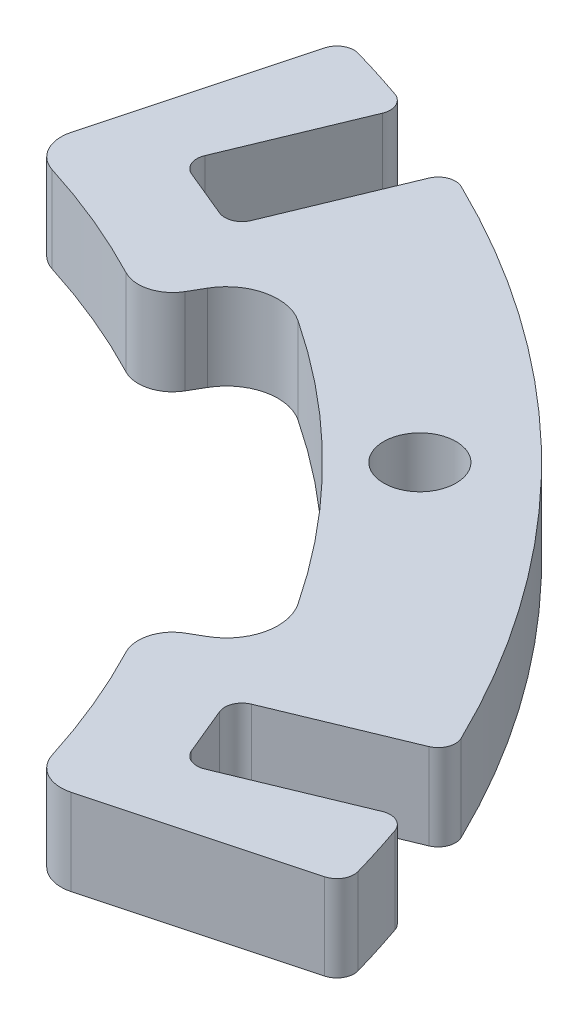
ISO-10303-21;
HEADER;
FILE_DESCRIPTION(('STEP AP214'),'2;1');
FILE_NAME('part.step','',(''),(''),'','','');
FILE_SCHEMA(('AUTOMOTIVE_DESIGN { 1 0 10303 214 1 1 1 1 }'));
ENDSEC;
DATA;
#1=APPLICATION_CONTEXT('core data for automotive mechanical design processes');
#2=APPLICATION_PROTOCOL_DEFINITION('international standard','automotive_design',2000,#1);
#3=PRODUCT_CONTEXT('',#1,'mechanical');
#4=PRODUCT('Part','Part','',(#3));
#5=PRODUCT_RELATED_PRODUCT_CATEGORY('part','',(#4));
#6=PRODUCT_DEFINITION_FORMATION('','',#4);
#7=PRODUCT_DEFINITION_CONTEXT('part definition',#1,'design');
#8=PRODUCT_DEFINITION('design','',#6,#7);
#9=PRODUCT_DEFINITION_SHAPE('','',#8);
#10=(LENGTH_UNIT() NAMED_UNIT(*) SI_UNIT(.MILLI.,.METRE.));
#11=(NAMED_UNIT(*) PLANE_ANGLE_UNIT() SI_UNIT($,.RADIAN.));
#12=(NAMED_UNIT(*) SI_UNIT($,.STERADIAN.) SOLID_ANGLE_UNIT());
#13=UNCERTAINTY_MEASURE_WITH_UNIT(LENGTH_MEASURE(1.E-05),#10,'distance_accuracy_value','');
#14=(GEOMETRIC_REPRESENTATION_CONTEXT(3) GLOBAL_UNCERTAINTY_ASSIGNED_CONTEXT((#13)) GLOBAL_UNIT_ASSIGNED_CONTEXT((#10,
#11,#12)) REPRESENTATION_CONTEXT('',''));
#15=CARTESIAN_POINT('',(0.,0.,0.));
#16=DIRECTION('',(0.,0.,1.));
#17=DIRECTION('',(1.,0.,0.));
#18=AXIS2_PLACEMENT_3D('',#15,#16,#17);
#19=CARTESIAN_POINT('',(0.,5.,0.));
#20=DIRECTION('',(0.,-1.,0.));
#21=DIRECTION('',(0.,0.,-1.));
#22=AXIS2_PLACEMENT_3D('',#19,#20,#21);
#23=CYLINDRICAL_SURFACE('',#22,60.);
#24=CARTESIAN_POINT('',(0.,0.,0.));
#25=DIRECTION('',(0.,1.,0.));
#26=DIRECTION('',(0.,0.,1.));
#27=AXIS2_PLACEMENT_3D('',#24,#25,#26);
#28=CIRCLE('',#27,60.);
#29=CARTESIAN_POINT('',(57.6840186161579,0.,-16.5092094386965));
#30=VERTEX_POINT('',#29);
#31=CARTESIAN_POINT('',(56.6972427250222,0.,-19.632184478043));
#32=VERTEX_POINT('',#31);
#33=EDGE_CURVE('E364',#30,#32,#28,.T.);
#34=ORIENTED_EDGE('',*,*,#33,.T.);
#35=DIRECTION('',(0.,-1.,0.));
#36=VECTOR('',#35,1.);
#37=CARTESIAN_POINT('',(56.6972427250222,5.,-19.632184478043));
#38=LINE('',#37,#36);
#39=CARTESIAN_POINT('',(56.6972427250222,5.,-19.632184478043));
#40=VERTEX_POINT('',#39);
#41=EDGE_CURVE('E425',#32,#40,#38,.F.);
#42=ORIENTED_EDGE('',*,*,#41,.T.);
#43=CARTESIAN_POINT('',(0.,5.,0.));
#44=DIRECTION('',(0.,1.,0.));
#45=DIRECTION('',(0.,0.,1.));
#46=AXIS2_PLACEMENT_3D('',#43,#44,#45);
#47=CIRCLE('',#46,60.);
#48=CARTESIAN_POINT('',(57.6840186161579,5.,-16.5092094386965));
#49=VERTEX_POINT('',#48);
#50=EDGE_CURVE('E358',#49,#40,#47,.T.);
#51=ORIENTED_EDGE('',*,*,#50,.F.);
#52=DIRECTION('',(0.,-1.,0.));
#53=VECTOR('',#52,1.);
#54=CARTESIAN_POINT('',(57.6840186161579,5.,-16.5092094386965));
#55=LINE('',#54,#53);
#56=EDGE_CURVE('E375',#49,#30,#55,.T.);
#57=ORIENTED_EDGE('',*,*,#56,.T.);
#58=EDGE_LOOP('',(#34,#42,#51,#57));
#59=FACE_BOUND('',#58,.T.);
#60=ADVANCED_FACE('F35',(#59),#23,.T.);
#61=CARTESIAN_POINT('',(53.9730555793724,5.,-26.2089540315132));
#62=VERTEX_POINT('',#61);
#63=CARTESIAN_POINT('',(26.2089540315133,5.,-53.9730555793724));
#64=VERTEX_POINT('',#63);
#65=EDGE_CURVE('E362',#62,#64,#47,.T.);
#66=ORIENTED_EDGE('',*,*,#65,.F.);
#67=DIRECTION('',(0.,-1.,0.));
#68=VECTOR('',#67,1.);
#69=CARTESIAN_POINT('',(53.9730555793724,5.,-26.2089540315132));
#70=LINE('',#69,#68);
#71=CARTESIAN_POINT('',(53.9730555793724,0.,-26.2089540315132));
#72=VERTEX_POINT('',#71);
#73=EDGE_CURVE('E448',#62,#72,#70,.T.);
#74=ORIENTED_EDGE('',*,*,#73,.T.);
#75=CARTESIAN_POINT('',(26.2089540315133,0.,-53.9730555793724));
#76=VERTEX_POINT('',#75);
#77=EDGE_CURVE('E367',#72,#76,#28,.T.);
#78=ORIENTED_EDGE('',*,*,#77,.T.);
#79=DIRECTION('',(0.,-1.,0.));
#80=VECTOR('',#79,1.);
#81=CARTESIAN_POINT('',(26.2089540315133,5.,-53.9730555793724));
#82=LINE('',#81,#80);
#83=EDGE_CURVE('E386',#76,#64,#82,.F.);
#84=ORIENTED_EDGE('',*,*,#83,.T.);
#85=EDGE_LOOP('',(#66,#74,#78,#84));
#86=FACE_BOUND('',#85,.T.);
#87=ADVANCED_FACE('F510',(#86),#23,.T.);
#88=CARTESIAN_POINT('',(0.,5.,0.));
#89=DIRECTION('',(0.,1.,0.));
#90=DIRECTION('',(0.,0.,1.));
#91=AXIS2_PLACEMENT_3D('',#88,#89,#90);
#92=PLANE('',#91);
#93=ORIENTED_EDGE('',*,*,#50,.T.);
#94=CARTESIAN_POINT('',(55.7522886796052,5.,-19.304981403409));
#95=DIRECTION('',(0.,1.,0.));
#96=DIRECTION('',(0.,0.,1.));
#97=AXIS2_PLACEMENT_3D('',#94,#95,#96);
#98=CIRCLE('',#97,1.);
#99=CARTESIAN_POINT('',(55.3696052472401,5.,-20.2288609359203));
#100=VERTEX_POINT('',#99);
#101=EDGE_CURVE('E430',#40,#100,#98,.T.);
#102=ORIENTED_EDGE('',*,*,#101,.T.);
#103=DIRECTION('',(0.923879532511285,0.,-0.382683432365095));
#104=VECTOR('',#103,1.);
#105=CARTESIAN_POINT('',(47.1506852064771,5.,-16.8244727869762));
#106=LINE('',#105,#104);
#107=CARTESIAN_POINT('',(48.0745647389884,5.,-17.2071562193413));
#108=VERTEX_POINT('',#107);
#109=EDGE_CURVE('E467',#108,#100,#106,.T.);
#110=ORIENTED_EDGE('',*,*,#109,.F.);
#111=CARTESIAN_POINT('',(47.6918813066233,5.,-18.1310357518526));
#112=DIRECTION('',(0.,1.,0.));
#113=DIRECTION('',(0.,0.,1.));
#114=AXIS2_PLACEMENT_3D('',#111,#112,#113);
#115=CIRCLE('',#114,1.);
#116=CARTESIAN_POINT('',(46.768001774112,5.,-17.7483523194875));
#117=VERTEX_POINT('',#116);
#118=EDGE_CURVE('E451',#108,#117,#115,.F.);
#119=ORIENTED_EDGE('',*,*,#118,.T.);
#120=DIRECTION('',(0.382683432365096,0.,0.923879532511284));
#121=VECTOR('',#120,1.);
#122=CARTESIAN_POINT('',(45.2372680446517,5.,-21.4438704495326));
#123=LINE('',#122,#121);
#124=CARTESIAN_POINT('',(45.6199514770167,5.,-20.5199909170213));
#125=VERTEX_POINT('',#124);
#126=EDGE_CURVE('E462',#125,#117,#123,.T.);
#127=ORIENTED_EDGE('',*,*,#126,.F.);
#128=CARTESIAN_POINT('',(46.543831009528,5.,-20.9026743493864));
#129=DIRECTION('',(0.,1.,0.));
#130=DIRECTION('',(0.,0.,1.));
#131=AXIS2_PLACEMENT_3D('',#128,#129,#130);
#132=CIRCLE('',#131,1.);
#133=CARTESIAN_POINT('',(46.1611475771629,5.,-21.8265538818977));
#134=VERTEX_POINT('',#133);
#135=EDGE_CURVE('E43',#125,#134,#132,.F.);
#136=ORIENTED_EDGE('',*,*,#135,.T.);
#137=DIRECTION('',(-0.923879532511285,0.,0.382683432365095));
#138=VECTOR('',#137,1.);
#139=CARTESIAN_POINT('',(45.2372680446517,5.,-21.4438704495326));
#140=LINE('',#139,#138);
#141=CARTESIAN_POINT('',(53.4561880854147,5.,-24.8482585984767));
#142=VERTEX_POINT('',#141);
#143=EDGE_CURVE('E459',#142,#134,#140,.T.);
#144=ORIENTED_EDGE('',*,*,#143,.F.);
#145=CARTESIAN_POINT('',(53.0735046530496,5.,-25.772138130988));
#146=DIRECTION('',(0.,1.,0.));
#147=DIRECTION('',(0.,0.,1.));
#148=AXIS2_PLACEMENT_3D('',#145,#146,#147);
#149=CIRCLE('',#148,1.);
#150=EDGE_CURVE('E428',#142,#62,#149,.T.);
#151=ORIENTED_EDGE('',*,*,#150,.T.);
#152=ORIENTED_EDGE('',*,*,#65,.T.);
#153=CARTESIAN_POINT('',(25.772138130988,5.,-53.0735046530496));
#154=DIRECTION('',(0.,1.,0.));
#155=DIRECTION('',(0.,0.,1.));
#156=AXIS2_PLACEMENT_3D('',#153,#154,#155);
#157=CIRCLE('',#156,1.);
#158=CARTESIAN_POINT('',(24.8482585984768,5.,-53.4561880854146));
#159=VERTEX_POINT('',#158);
#160=EDGE_CURVE('E391',#64,#159,#157,.T.);
#161=ORIENTED_EDGE('',*,*,#160,.T.);
#162=DIRECTION('',(0.382683432365083,0.,-0.92387953251129));
#163=VECTOR('',#162,1.);
#164=CARTESIAN_POINT('',(21.4438704495327,5.,-45.2372680446516));
#165=LINE('',#164,#163);
#166=CARTESIAN_POINT('',(21.8265538818978,5.,-46.1611475771629));
#167=VERTEX_POINT('',#166);
#168=EDGE_CURVE('E478',#167,#159,#165,.T.);
#169=ORIENTED_EDGE('',*,*,#168,.F.);
#170=CARTESIAN_POINT('',(20.9026743493865,5.,-46.543831009528));
#171=DIRECTION('',(0.,1.,0.));
#172=DIRECTION('',(0.,0.,1.));
#173=AXIS2_PLACEMENT_3D('',#170,#171,#172);
#174=CIRCLE('',#173,1.);
#175=CARTESIAN_POINT('',(20.5199909170215,5.,-45.6199514770167));
#176=VERTEX_POINT('',#175);
#177=EDGE_CURVE('E415',#167,#176,#174,.F.);
#178=ORIENTED_EDGE('',*,*,#177,.T.);
#179=DIRECTION('',(0.92387953251129,0.,0.382683432365082));
#180=VECTOR('',#179,1.);
#181=CARTESIAN_POINT('',(16.8244727869763,5.,-47.150685206477));
#182=LINE('',#181,#180);
#183=CARTESIAN_POINT('',(17.7483523194876,5.,-46.768001774112));
#184=VERTEX_POINT('',#183);
#185=EDGE_CURVE('E493',#184,#176,#182,.T.);
#186=ORIENTED_EDGE('',*,*,#185,.F.);
#187=CARTESIAN_POINT('',(18.1310357518527,5.,-47.6918813066232));
#188=DIRECTION('',(0.,1.,0.));
#189=DIRECTION('',(0.,0.,1.));
#190=AXIS2_PLACEMENT_3D('',#187,#188,#189);
#191=CIRCLE('',#190,1.);
#192=CARTESIAN_POINT('',(17.2071562193414,5.,-48.0745647389883));
#193=VERTEX_POINT('',#192);
#194=EDGE_CURVE('E419',#184,#193,#191,.F.);
#195=ORIENTED_EDGE('',*,*,#194,.T.);
#196=DIRECTION('',(-0.382683432365083,0.,0.92387953251129));
#197=VECTOR('',#196,1.);
#198=CARTESIAN_POINT('',(16.8244727869763,5.,-47.150685206477));
#199=LINE('',#198,#197);
#200=CARTESIAN_POINT('',(20.2288609359203,5.,-55.3696052472401));
#201=VERTEX_POINT('',#200);
#202=EDGE_CURVE('E482',#201,#193,#199,.T.);
#203=ORIENTED_EDGE('',*,*,#202,.F.);
#204=CARTESIAN_POINT('',(19.304981403409,5.,-55.7522886796052));
#205=DIRECTION('',(0.,1.,0.));
#206=DIRECTION('',(0.,0.,1.));
#207=AXIS2_PLACEMENT_3D('',#204,#205,#206);
#208=CIRCLE('',#207,1.);
#209=CARTESIAN_POINT('',(19.6321844780431,5.,-56.6972427250222));
#210=VERTEX_POINT('',#209);
#211=EDGE_CURVE('E389',#201,#210,#208,.T.);
#212=ORIENTED_EDGE('',*,*,#211,.T.);
#213=CARTESIAN_POINT('',(16.5092094386966,5.,-57.6840186161579));
#214=VERTEX_POINT('',#213);
#215=EDGE_CURVE('E363',#210,#214,#47,.T.);
#216=ORIENTED_EDGE('',*,*,#215,.T.);
#217=CARTESIAN_POINT('',(16.2340559480516,5.,-56.7226183058886));
#218=DIRECTION('',(0.,1.,0.));
#219=DIRECTION('',(0.,0.,1.));
#220=AXIS2_PLACEMENT_3D('',#217,#218,#219);
#221=CIRCLE('',#220,1.);
#222=CARTESIAN_POINT('',(15.2681301217625,5.,-56.9814373509911));
#223=VERTEX_POINT('',#222);
#224=EDGE_CURVE('E382',#214,#223,#221,.T.);
#225=ORIENTED_EDGE('',*,*,#224,.T.);
#226=DIRECTION('',(0.258819045102507,0.,-0.965925826289072));
#227=VECTOR('',#226,1.);
#228=CARTESIAN_POINT('',(12.3990261374576,5.,-46.2737955093662));
#229=LINE('',#228,#227);
#230=CARTESIAN_POINT('',(12.1534765531373,5.,-45.3573919849052));
#231=VERTEX_POINT('',#230);
#232=EDGE_CURVE('E340',#231,#223,#229,.T.);
#233=ORIENTED_EDGE('',*,*,#232,.F.);
#234=CARTESIAN_POINT('',(14.0853282057154,5.,-44.8397538947002));
#235=DIRECTION('',(0.,-1.,0.));
#236=DIRECTION('',(0.,0.,1.));
#237=AXIS2_PLACEMENT_3D('',#234,#235,#236);
#238=CIRCLE('',#237,2.00000000000001);
#239=CARTESIAN_POINT('',(13.4859525373871,5.,-42.9316792608831));
#240=VERTEX_POINT('',#239);
#241=EDGE_CURVE('E321',#240,#231,#238,.T.);
#242=ORIENTED_EDGE('',*,*,#241,.F.);
#243=CARTESIAN_POINT('',(0.,5.,0.));
#244=DIRECTION('',(0.,1.,0.));
#245=DIRECTION('',(0.,0.,1.));
#246=AXIS2_PLACEMENT_3D('',#243,#244,#245);
#247=CIRCLE('',#246,45.);
#248=CARTESIAN_POINT('',(20.8212730431501,5.,-39.8932900230426));
#249=VERTEX_POINT('',#248);
#250=EDGE_CURVE('E353',#249,#240,#247,.T.);
#251=ORIENTED_EDGE('',*,*,#250,.F.);
#252=CARTESIAN_POINT('',(21.746662956179,5.,-41.6663251351779));
#253=DIRECTION('',(0.,-1.,0.));
#254=DIRECTION('',(0.707106781186549,0.,-0.707106781186546));
#255=AXIS2_PLACEMENT_3D('',#252,#253,#254);
#256=CIRCLE('',#255,2.00000000000001);
#257=CARTESIAN_POINT('',(23.4787137637478,5.,-40.6663251351779));
#258=VERTEX_POINT('',#257);
#259=EDGE_CURVE('E282',#258,#249,#256,.T.);
#260=ORIENTED_EDGE('',*,*,#259,.F.);
#261=DIRECTION('',(-0.500000000000007,0.,0.866025403784435));
#262=VECTOR('',#261,1.);
#263=CARTESIAN_POINT('',(23.953079134007,5.,-41.487950057818));
#264=LINE('',#263,#262);
#265=CARTESIAN_POINT('',(23.953079134007,5.,-41.487950057818));
#266=VERTEX_POINT('',#265);
#267=EDGE_CURVE('E315',#266,#258,#264,.T.);
#268=ORIENTED_EDGE('',*,*,#267,.F.);
#269=CARTESIAN_POINT('',(26.5511553453603,5.,-39.987950057818));
#270=DIRECTION('',(0.,1.,0.));
#271=DIRECTION('',(-0.707106781186549,0.,0.707106781186546));
#272=AXIS2_PLACEMENT_3D('',#269,#270,#271);
#273=CIRCLE('',#272,3.);
#274=CARTESIAN_POINT('',(28.2106025544454,5.,-42.4871969364316));
#275=VERTEX_POINT('',#274);
#276=EDGE_CURVE('E312',#275,#266,#273,.T.);
#277=ORIENTED_EDGE('',*,*,#276,.F.);
#278=CARTESIAN_POINT('',(0.,5.,0.));
#279=DIRECTION('',(0.,1.,0.));
#280=DIRECTION('',(-0.707106781186549,0.,0.707106781186546));
#281=AXIS2_PLACEMENT_3D('',#278,#279,#280);
#282=CIRCLE('',#281,51.);
#283=CARTESIAN_POINT('',(42.4871969364317,5.,-28.2106025544452));
#284=VERTEX_POINT('',#283);
#285=EDGE_CURVE('E309',#284,#275,#282,.T.);
#286=ORIENTED_EDGE('',*,*,#285,.F.);
#287=CARTESIAN_POINT('',(39.9879500578181,5.,-26.5511553453602));
#288=DIRECTION('',(0.,1.,0.));
#289=DIRECTION('',(0.707106781186549,0.,-0.707106781186546));
#290=AXIS2_PLACEMENT_3D('',#287,#288,#289);
#291=CIRCLE('',#290,3.);
#292=CARTESIAN_POINT('',(41.4879500578181,5.,-23.9530791340069));
#293=VERTEX_POINT('',#292);
#294=EDGE_CURVE('E306',#293,#284,#291,.T.);
#295=ORIENTED_EDGE('',*,*,#294,.F.);
#296=DIRECTION('',(0.866025403784432,0.,-0.500000000000011));
#297=VECTOR('',#296,1.);
#298=CARTESIAN_POINT('',(41.4879500578181,5.,-23.9530791340069));
#299=LINE('',#298,#297);
#300=CARTESIAN_POINT('',(40.666325135178,5.,-23.4787137637477));
#301=VERTEX_POINT('',#300);
#302=EDGE_CURVE('E303',#301,#293,#299,.T.);
#303=ORIENTED_EDGE('',*,*,#302,.F.);
#304=CARTESIAN_POINT('',(41.666325135178,5.,-21.7466629561788));
#305=DIRECTION('',(0.,-1.,0.));
#306=DIRECTION('',(-0.707106781186549,0.,0.707106781186546));
#307=AXIS2_PLACEMENT_3D('',#304,#305,#306);
#308=CIRCLE('',#307,2.00000000000001);
#309=CARTESIAN_POINT('',(39.8932900230427,5.,-20.8212730431499));
#310=VERTEX_POINT('',#309);
#311=EDGE_CURVE('E276',#310,#301,#308,.T.);
#312=ORIENTED_EDGE('',*,*,#311,.F.);
#313=CARTESIAN_POINT('',(42.9316792608832,5.,-13.485952537387));
#314=VERTEX_POINT('',#313);
#315=EDGE_CURVE('E355',#314,#310,#247,.T.);
#316=ORIENTED_EDGE('',*,*,#315,.F.);
#317=CARTESIAN_POINT('',(44.8397538947002,5.,-14.0853282057153));
#318=DIRECTION('',(0.,-1.,0.));
#319=DIRECTION('',(1.,0.,0.));
#320=AXIS2_PLACEMENT_3D('',#317,#318,#319);
#321=CIRCLE('',#320,2.00000000000001);
#322=CARTESIAN_POINT('',(45.3573919849053,5.,-12.1534765531371));
#323=VERTEX_POINT('',#322);
#324=EDGE_CURVE('E257',#323,#314,#321,.T.);
#325=ORIENTED_EDGE('',*,*,#324,.F.);
#326=DIRECTION('',(-0.965925826289071,0.,0.258819045102512));
#327=VECTOR('',#326,1.);
#328=CARTESIAN_POINT('',(46.2737955093663,5.,-12.3990261374575));
#329=LINE('',#328,#327);
#330=CARTESIAN_POINT('',(56.9814373509912,5.,-15.2681301217625));
#331=VERTEX_POINT('',#330);
#332=EDGE_CURVE('E263',#331,#323,#329,.T.);
#333=ORIENTED_EDGE('',*,*,#332,.F.);
#334=CARTESIAN_POINT('',(56.7226183058886,5.,-16.2340559480515));
#335=DIRECTION('',(0.,1.,0.));
#336=DIRECTION('',(0.,0.,1.));
#337=AXIS2_PLACEMENT_3D('',#334,#335,#336);
#338=CIRCLE('',#337,1.);
#339=EDGE_CURVE('E380',#331,#49,#338,.T.);
#340=ORIENTED_EDGE('',*,*,#339,.T.);
#341=EDGE_LOOP('',(#93,#102,#110,#119,#127,#136,#144,#151,#152,#161,#169,#178,#186,#195,#203,
#212,#216,#225,#233,#242,#251,#260,#268,#277,#286,#295,#303,#312,#316,#325,#333,#340));
#342=FACE_BOUND('',#341,.T.);
#343=CARTESIAN_POINT('',(38.8908729652602,5.,-38.89087296526));
#344=DIRECTION('',(0.,1.,0.));
#345=DIRECTION('',(0.,0.,1.));
#346=AXIS2_PLACEMENT_3D('',#343,#344,#345);
#347=CIRCLE('',#346,2.1);
#348=CARTESIAN_POINT('',(38.8908729652602,5.,-36.79087296526));
#349=VERTEX_POINT('',#348);
#350=EDGE_CURVE('E498',#349,#349,#347,.T.);
#351=ORIENTED_EDGE('',*,*,#350,.F.);
#352=EDGE_LOOP('',(#351));
#353=FACE_BOUND('',#352,.T.);
#354=ADVANCED_FACE('F457',(#342,#353),#92,.T.);
#355=CARTESIAN_POINT('',(0.,0.,0.));
#356=DIRECTION('',(0.,1.,0.));
#357=DIRECTION('',(0.,0.,1.));
#358=AXIS2_PLACEMENT_3D('',#355,#356,#357);
#359=PLANE('',#358);
#360=CARTESIAN_POINT('',(38.8908729652602,0.,-38.89087296526));
#361=DIRECTION('',(0.,1.,0.));
#362=DIRECTION('',(0.,0.,1.));
#363=AXIS2_PLACEMENT_3D('',#360,#361,#362);
#364=CIRCLE('',#363,2.1);
#365=CARTESIAN_POINT('',(38.8908729652602,0.,-36.79087296526));
#366=VERTEX_POINT('',#365);
#367=EDGE_CURVE('E274',#366,#366,#364,.T.);
#368=ORIENTED_EDGE('',*,*,#367,.T.);
#369=EDGE_LOOP('',(#368));
#370=FACE_BOUND('',#369,.T.);
#371=DIRECTION('',(0.923879532511285,0.,-0.382683432365095));
#372=VECTOR('',#371,1.);
#373=CARTESIAN_POINT('',(47.1506852064771,0.,-16.8244727869762));
#374=LINE('',#373,#372);
#375=CARTESIAN_POINT('',(48.0745647389884,0.,-17.2071562193413));
#376=VERTEX_POINT('',#375);
#377=CARTESIAN_POINT('',(55.3696052472401,0.,-20.2288609359203));
#378=VERTEX_POINT('',#377);
#379=EDGE_CURVE('E479',#376,#378,#374,.T.);
#380=ORIENTED_EDGE('',*,*,#379,.T.);
#381=CARTESIAN_POINT('',(55.7522886796052,0.,-19.304981403409));
#382=DIRECTION('',(0.,1.,0.));
#383=DIRECTION('',(0.,0.,1.));
#384=AXIS2_PLACEMENT_3D('',#381,#382,#383);
#385=CIRCLE('',#384,1.);
#386=EDGE_CURVE('E438',#378,#32,#385,.F.);
#387=ORIENTED_EDGE('',*,*,#386,.T.);
#388=ORIENTED_EDGE('',*,*,#33,.F.);
#389=CARTESIAN_POINT('',(56.7226183058886,0.,-16.2340559480515));
#390=DIRECTION('',(0.,1.,0.));
#391=DIRECTION('',(0.,0.,1.));
#392=AXIS2_PLACEMENT_3D('',#389,#390,#391);
#393=CIRCLE('',#392,1.);
#394=CARTESIAN_POINT('',(56.9814373509912,0.,-15.2681301217625));
#395=VERTEX_POINT('',#394);
#396=EDGE_CURVE('E253',#30,#395,#393,.F.);
#397=ORIENTED_EDGE('',*,*,#396,.T.);
#398=DIRECTION('',(-0.965925826289071,0.,0.258819045102512));
#399=VECTOR('',#398,1.);
#400=CARTESIAN_POINT('',(46.2737955093663,0.,-12.3990261374575));
#401=LINE('',#400,#399);
#402=CARTESIAN_POINT('',(45.3573919849053,0.,-12.1534765531371));
#403=VERTEX_POINT('',#402);
#404=EDGE_CURVE('E243',#395,#403,#401,.T.);
#405=ORIENTED_EDGE('',*,*,#404,.T.);
#406=CARTESIAN_POINT('',(44.8397538947002,0.,-14.0853282057153));
#407=DIRECTION('',(0.,-1.,0.));
#408=DIRECTION('',(1.,0.,0.));
#409=AXIS2_PLACEMENT_3D('',#406,#407,#408);
#410=CIRCLE('',#409,2.00000000000001);
#411=CARTESIAN_POINT('',(42.9316792608832,0.,-13.4859525373869));
#412=VERTEX_POINT('',#411);
#413=EDGE_CURVE('E249',#403,#412,#410,.T.);
#414=ORIENTED_EDGE('',*,*,#413,.T.);
#415=CARTESIAN_POINT('',(0.,0.,0.));
#416=DIRECTION('',(0.,1.,0.));
#417=DIRECTION('',(0.,0.,1.));
#418=AXIS2_PLACEMENT_3D('',#415,#416,#417);
#419=CIRCLE('',#418,45.);
#420=CARTESIAN_POINT('',(39.8932900230427,0.,-20.8212730431499));
#421=VERTEX_POINT('',#420);
#422=EDGE_CURVE('E356',#412,#421,#419,.T.);
#423=ORIENTED_EDGE('',*,*,#422,.T.);
#424=CARTESIAN_POINT('',(41.666325135178,0.,-21.7466629561788));
#425=DIRECTION('',(0.,-1.,0.));
#426=DIRECTION('',(-0.707106781186549,0.,0.707106781186546));
#427=AXIS2_PLACEMENT_3D('',#424,#425,#426);
#428=CIRCLE('',#427,2.00000000000001);
#429=CARTESIAN_POINT('',(40.666325135178,0.,-23.4787137637477));
#430=VERTEX_POINT('',#429);
#431=EDGE_CURVE('E278',#421,#430,#428,.T.);
#432=ORIENTED_EDGE('',*,*,#431,.T.);
#433=DIRECTION('',(0.866025403784432,0.,-0.500000000000011));
#434=VECTOR('',#433,1.);
#435=CARTESIAN_POINT('',(41.4879500578181,0.,-23.9530791340069));
#436=LINE('',#435,#434);
#437=CARTESIAN_POINT('',(41.4879500578181,0.,-23.9530791340069));
#438=VERTEX_POINT('',#437);
#439=EDGE_CURVE('E281',#430,#438,#436,.T.);
#440=ORIENTED_EDGE('',*,*,#439,.T.);
#441=CARTESIAN_POINT('',(39.9879500578181,0.,-26.5511553453602));
#442=DIRECTION('',(0.,1.,0.));
#443=DIRECTION('',(0.707106781186549,0.,-0.707106781186546));
#444=AXIS2_PLACEMENT_3D('',#441,#442,#443);
#445=CIRCLE('',#444,3.);
#446=CARTESIAN_POINT('',(42.4871969364317,0.,-28.2106025544452));
#447=VERTEX_POINT('',#446);
#448=EDGE_CURVE('E285',#438,#447,#445,.T.);
#449=ORIENTED_EDGE('',*,*,#448,.T.);
#450=CARTESIAN_POINT('',(0.,0.,0.));
#451=DIRECTION('',(0.,1.,0.));
#452=DIRECTION('',(-0.707106781186549,0.,0.707106781186546));
#453=AXIS2_PLACEMENT_3D('',#450,#451,#452);
#454=CIRCLE('',#453,51.);
#455=CARTESIAN_POINT('',(28.2106025544454,0.,-42.4871969364316));
#456=VERTEX_POINT('',#455);
#457=EDGE_CURVE('E288',#447,#456,#454,.T.);
#458=ORIENTED_EDGE('',*,*,#457,.T.);
#459=CARTESIAN_POINT('',(26.5511553453603,0.,-39.987950057818));
#460=DIRECTION('',(0.,1.,0.));
#461=DIRECTION('',(-0.707106781186549,0.,0.707106781186546));
#462=AXIS2_PLACEMENT_3D('',#459,#460,#461);
#463=CIRCLE('',#462,3.);
#464=CARTESIAN_POINT('',(23.953079134007,0.,-41.487950057818));
#465=VERTEX_POINT('',#464);
#466=EDGE_CURVE('E291',#456,#465,#463,.T.);
#467=ORIENTED_EDGE('',*,*,#466,.T.);
#468=DIRECTION('',(-0.500000000000007,0.,0.866025403784435));
#469=VECTOR('',#468,1.);
#470=CARTESIAN_POINT('',(23.953079134007,0.,-41.487950057818));
#471=LINE('',#470,#469);
#472=CARTESIAN_POINT('',(23.4787137637478,0.,-40.6663251351779));
#473=VERTEX_POINT('',#472);
#474=EDGE_CURVE('E294',#465,#473,#471,.T.);
#475=ORIENTED_EDGE('',*,*,#474,.T.);
#476=CARTESIAN_POINT('',(21.746662956179,0.,-41.6663251351779));
#477=DIRECTION('',(0.,-1.,0.));
#478=DIRECTION('',(0.707106781186549,0.,-0.707106781186546));
#479=AXIS2_PLACEMENT_3D('',#476,#477,#478);
#480=CIRCLE('',#479,2.00000000000001);
#481=CARTESIAN_POINT('',(20.8212730431501,0.,-39.8932900230426));
#482=VERTEX_POINT('',#481);
#483=EDGE_CURVE('E297',#473,#482,#480,.T.);
#484=ORIENTED_EDGE('',*,*,#483,.T.);
#485=CARTESIAN_POINT('',(13.4859525373871,0.,-42.9316792608831));
#486=VERTEX_POINT('',#485);
#487=EDGE_CURVE('E351',#482,#486,#419,.T.);
#488=ORIENTED_EDGE('',*,*,#487,.T.);
#489=CARTESIAN_POINT('',(14.0853282057154,0.,-44.8397538947002));
#490=DIRECTION('',(0.,-1.,0.));
#491=DIRECTION('',(0.,0.,1.));
#492=AXIS2_PLACEMENT_3D('',#489,#490,#491);
#493=CIRCLE('',#492,2.00000000000001);
#494=CARTESIAN_POINT('',(12.1534765531373,0.,-45.3573919849052));
#495=VERTEX_POINT('',#494);
#496=EDGE_CURVE('E336',#486,#495,#493,.T.);
#497=ORIENTED_EDGE('',*,*,#496,.T.);
#498=DIRECTION('',(0.258819045102507,0.,-0.965925826289072));
#499=VECTOR('',#498,1.);
#500=CARTESIAN_POINT('',(12.3990261374576,0.,-46.2737955093662));
#501=LINE('',#500,#499);
#502=CARTESIAN_POINT('',(15.2681301217625,0.,-56.9814373509911));
#503=VERTEX_POINT('',#502);
#504=EDGE_CURVE('E339',#495,#503,#501,.T.);
#505=ORIENTED_EDGE('',*,*,#504,.T.);
#506=CARTESIAN_POINT('',(16.2340559480516,0.,-56.7226183058886));
#507=DIRECTION('',(0.,1.,0.));
#508=DIRECTION('',(0.,0.,1.));
#509=AXIS2_PLACEMENT_3D('',#506,#507,#508);
#510=CIRCLE('',#509,1.);
#511=CARTESIAN_POINT('',(16.5092094386966,0.,-57.6840186161579));
#512=VERTEX_POINT('',#511);
#513=EDGE_CURVE('E372',#503,#512,#510,.F.);
#514=ORIENTED_EDGE('',*,*,#513,.T.);
#515=CARTESIAN_POINT('',(19.6321844780431,0.,-56.6972427250222));
#516=VERTEX_POINT('',#515);
#517=EDGE_CURVE('E368',#516,#512,#28,.T.);
#518=ORIENTED_EDGE('',*,*,#517,.F.);
#519=CARTESIAN_POINT('',(19.304981403409,0.,-55.7522886796052));
#520=DIRECTION('',(0.,1.,0.));
#521=DIRECTION('',(0.,0.,1.));
#522=AXIS2_PLACEMENT_3D('',#519,#520,#521);
#523=CIRCLE('',#522,1.);
#524=CARTESIAN_POINT('',(20.2288609359203,0.,-55.3696052472401));
#525=VERTEX_POINT('',#524);
#526=EDGE_CURVE('E398',#516,#525,#523,.F.);
#527=ORIENTED_EDGE('',*,*,#526,.T.);
#528=DIRECTION('',(-0.382683432365083,0.,0.92387953251129));
#529=VECTOR('',#528,1.);
#530=CARTESIAN_POINT('',(16.8244727869763,0.,-47.150685206477));
#531=LINE('',#530,#529);
#532=CARTESIAN_POINT('',(17.2071562193414,0.,-48.0745647389883));
#533=VERTEX_POINT('',#532);
#534=EDGE_CURVE('E492',#525,#533,#531,.T.);
#535=ORIENTED_EDGE('',*,*,#534,.T.);
#536=CARTESIAN_POINT('',(18.1310357518527,0.,-47.6918813066232));
#537=DIRECTION('',(0.,1.,0.));
#538=DIRECTION('',(0.,0.,1.));
#539=AXIS2_PLACEMENT_3D('',#536,#537,#538);
#540=CIRCLE('',#539,1.);
#541=CARTESIAN_POINT('',(17.7483523194876,0.,-46.768001774112));
#542=VERTEX_POINT('',#541);
#543=EDGE_CURVE('E421',#533,#542,#540,.T.);
#544=ORIENTED_EDGE('',*,*,#543,.T.);
#545=DIRECTION('',(0.92387953251129,0.,0.382683432365082));
#546=VECTOR('',#545,1.);
#547=CARTESIAN_POINT('',(16.8244727869763,0.,-47.150685206477));
#548=LINE('',#547,#546);
#549=CARTESIAN_POINT('',(20.5199909170215,0.,-45.6199514770167));
#550=VERTEX_POINT('',#549);
#551=EDGE_CURVE('E496',#542,#550,#548,.T.);
#552=ORIENTED_EDGE('',*,*,#551,.T.);
#553=CARTESIAN_POINT('',(20.9026743493865,0.,-46.543831009528));
#554=DIRECTION('',(0.,1.,0.));
#555=DIRECTION('',(0.,0.,1.));
#556=AXIS2_PLACEMENT_3D('',#553,#554,#555);
#557=CIRCLE('',#556,1.);
#558=CARTESIAN_POINT('',(21.8265538818978,0.,-46.1611475771629));
#559=VERTEX_POINT('',#558);
#560=EDGE_CURVE('E417',#550,#559,#557,.T.);
#561=ORIENTED_EDGE('',*,*,#560,.T.);
#562=DIRECTION('',(0.382683432365083,0.,-0.92387953251129));
#563=VECTOR('',#562,1.);
#564=CARTESIAN_POINT('',(21.4438704495327,0.,-45.2372680446516));
#565=LINE('',#564,#563);
#566=CARTESIAN_POINT('',(24.8482585984768,0.,-53.4561880854146));
#567=VERTEX_POINT('',#566);
#568=EDGE_CURVE('E489',#559,#567,#565,.T.);
#569=ORIENTED_EDGE('',*,*,#568,.T.);
#570=CARTESIAN_POINT('',(25.772138130988,0.,-53.0735046530496));
#571=DIRECTION('',(0.,1.,0.));
#572=DIRECTION('',(0.,0.,1.));
#573=AXIS2_PLACEMENT_3D('',#570,#571,#572);
#574=CIRCLE('',#573,1.);
#575=EDGE_CURVE('E400',#567,#76,#574,.F.);
#576=ORIENTED_EDGE('',*,*,#575,.T.);
#577=ORIENTED_EDGE('',*,*,#77,.F.);
#578=CARTESIAN_POINT('',(53.0735046530496,0.,-25.772138130988));
#579=DIRECTION('',(0.,1.,0.));
#580=DIRECTION('',(0.,0.,1.));
#581=AXIS2_PLACEMENT_3D('',#578,#579,#580);
#582=CIRCLE('',#581,1.);
#583=CARTESIAN_POINT('',(53.4561880854147,0.,-24.8482585984767));
#584=VERTEX_POINT('',#583);
#585=EDGE_CURVE('E57',#72,#584,#582,.F.);
#586=ORIENTED_EDGE('',*,*,#585,.T.);
#587=DIRECTION('',(-0.923879532511285,0.,0.382683432365095));
#588=VECTOR('',#587,1.);
#589=CARTESIAN_POINT('',(-0.956708580912585,0.,-2.30969883127784));
#590=LINE('',#589,#588);
#591=CARTESIAN_POINT('',(46.161147577163,0.,-21.8265538818977));
#592=VERTEX_POINT('',#591);
#593=EDGE_CURVE('E423',#584,#592,#590,.T.);
#594=ORIENTED_EDGE('',*,*,#593,.T.);
#595=CARTESIAN_POINT('',(46.543831009528,0.,-20.9026743493864));
#596=DIRECTION('',(0.,1.,0.));
#597=DIRECTION('',(0.,0.,1.));
#598=AXIS2_PLACEMENT_3D('',#595,#596,#597);
#599=CIRCLE('',#598,1.);
#600=CARTESIAN_POINT('',(45.6199514770167,0.,-20.5199909170213));
#601=VERTEX_POINT('',#600);
#602=EDGE_CURVE('E12',#592,#601,#599,.T.);
#603=ORIENTED_EDGE('',*,*,#602,.T.);
#604=DIRECTION('',(0.382683432365096,0.,0.923879532511284));
#605=VECTOR('',#604,1.);
#606=CARTESIAN_POINT('',(45.2372680446517,0.,-21.4438704495326));
#607=LINE('',#606,#605);
#608=CARTESIAN_POINT('',(46.768001774112,0.,-17.7483523194875));
#609=VERTEX_POINT('',#608);
#610=EDGE_CURVE('E473',#601,#609,#607,.T.);
#611=ORIENTED_EDGE('',*,*,#610,.T.);
#612=CARTESIAN_POINT('',(47.6918813066233,0.,-18.1310357518526));
#613=DIRECTION('',(0.,1.,0.));
#614=DIRECTION('',(0.,0.,1.));
#615=AXIS2_PLACEMENT_3D('',#612,#613,#614);
#616=CIRCLE('',#615,1.);
#617=EDGE_CURVE('E453',#609,#376,#616,.T.);
#618=ORIENTED_EDGE('',*,*,#617,.T.);
#619=EDGE_LOOP('',(#380,#387,#388,#397,#405,#414,#423,#432,#440,#449,#458,#467,#475,#484,#488,
#497,#505,#514,#518,#527,#535,#544,#552,#561,#569,#576,#577,#586,#594,#603,#611,#618));
#620=FACE_BOUND('',#619,.T.);
#621=ADVANCED_FACE('F246',(#370,#620),#359,.F.);
#622=ORIENTED_EDGE('',*,*,#215,.F.);
#623=DIRECTION('',(0.,-1.,0.));
#624=VECTOR('',#623,1.);
#625=CARTESIAN_POINT('',(19.6321844780431,5.,-56.6972427250222));
#626=LINE('',#625,#624);
#627=EDGE_CURVE('E412',#210,#516,#626,.T.);
#628=ORIENTED_EDGE('',*,*,#627,.T.);
#629=ORIENTED_EDGE('',*,*,#517,.T.);
#630=DIRECTION('',(0.,-1.,0.));
#631=VECTOR('',#630,1.);
#632=CARTESIAN_POINT('',(16.5092094386966,5.,-57.6840186161579));
#633=LINE('',#632,#631);
#634=EDGE_CURVE('E377',#512,#214,#633,.F.);
#635=ORIENTED_EDGE('',*,*,#634,.T.);
#636=EDGE_LOOP('',(#622,#628,#629,#635));
#637=FACE_BOUND('',#636,.T.);
#638=ADVANCED_FACE('F516',(#637),#23,.T.);
#639=CARTESIAN_POINT('',(0.,5.,0.));
#640=DIRECTION('',(0.,-1.,0.));
#641=DIRECTION('',(0.,0.,-1.));
#642=AXIS2_PLACEMENT_3D('',#639,#640,#641);
#643=CYLINDRICAL_SURFACE('',#642,45.);
#644=ORIENTED_EDGE('',*,*,#422,.F.);
#645=DIRECTION('',(0.,1.,0.));
#646=VECTOR('',#645,1.);
#647=CARTESIAN_POINT('',(42.9316792608832,0.,-13.4859525373869));
#648=LINE('',#647,#646);
#649=EDGE_CURVE('E266',#412,#314,#648,.T.);
#650=ORIENTED_EDGE('',*,*,#649,.T.);
#651=ORIENTED_EDGE('',*,*,#315,.T.);
#652=DIRECTION('',(0.,1.,0.));
#653=VECTOR('',#652,1.);
#654=CARTESIAN_POINT('',(39.8932900230427,0.,-20.8212730431499));
#655=LINE('',#654,#653);
#656=EDGE_CURVE('E319',#421,#310,#655,.T.);
#657=ORIENTED_EDGE('',*,*,#656,.F.);
#658=EDGE_LOOP('',(#644,#650,#651,#657));
#659=FACE_BOUND('',#658,.T.);
#660=ADVANCED_FACE('F528',(#659),#643,.F.);
#661=ORIENTED_EDGE('',*,*,#487,.F.);
#662=DIRECTION('',(0.,1.,0.));
#663=VECTOR('',#662,1.);
#664=CARTESIAN_POINT('',(20.8212730431501,0.,-39.8932900230426));
#665=LINE('',#664,#663);
#666=EDGE_CURVE('E322',#482,#249,#665,.T.);
#667=ORIENTED_EDGE('',*,*,#666,.T.);
#668=ORIENTED_EDGE('',*,*,#250,.T.);
#669=DIRECTION('',(0.,1.,0.));
#670=VECTOR('',#669,1.);
#671=CARTESIAN_POINT('',(13.4859525373871,0.,-42.9316792608831));
#672=LINE('',#671,#670);
#673=EDGE_CURVE('E348',#486,#240,#672,.T.);
#674=ORIENTED_EDGE('',*,*,#673,.F.);
#675=EDGE_LOOP('',(#661,#667,#668,#674));
#676=FACE_BOUND('',#675,.T.);
#677=ADVANCED_FACE('F533',(#676),#643,.F.);
#678=CARTESIAN_POINT('',(14.0853282057154,0.,-44.8397538947002));
#679=DIRECTION('',(0.,1.,0.));
#680=DIRECTION('',(0.,0.,1.));
#681=AXIS2_PLACEMENT_3D('',#678,#679,#680);
#682=CYLINDRICAL_SURFACE('',#681,2.00000000000001);
#683=ORIENTED_EDGE('',*,*,#241,.T.);
#684=DIRECTION('',(0.,1.,0.));
#685=VECTOR('',#684,1.);
#686=CARTESIAN_POINT('',(12.1534765531373,0.,-45.3573919849052));
#687=LINE('',#686,#685);
#688=EDGE_CURVE('E343',#495,#231,#687,.T.);
#689=ORIENTED_EDGE('',*,*,#688,.F.);
#690=ORIENTED_EDGE('',*,*,#496,.F.);
#691=ORIENTED_EDGE('',*,*,#673,.T.);
#692=EDGE_LOOP('',(#683,#689,#690,#691));
#693=FACE_BOUND('',#692,.T.);
#694=ADVANCED_FACE('F609',(#693),#682,.T.);
#695=CARTESIAN_POINT('',(12.3990261374576,0.,-46.2737955093662));
#696=DIRECTION('',(0.965925826289072,0.,0.258819045102507));
#697=DIRECTION('',(0.258819045102507,0.,-0.965925826289072));
#698=AXIS2_PLACEMENT_3D('',#695,#696,#697);
#699=PLANE('',#698);
#700=ORIENTED_EDGE('',*,*,#232,.T.);
#701=DIRECTION('',(0.,-1.,0.));
#702=VECTOR('',#701,1.);
#703=CARTESIAN_POINT('',(15.2681301217625,0.,-56.9814373509911));
#704=LINE('',#703,#702);
#705=EDGE_CURVE('E361',#223,#503,#704,.T.);
#706=ORIENTED_EDGE('',*,*,#705,.T.);
#707=ORIENTED_EDGE('',*,*,#504,.F.);
#708=ORIENTED_EDGE('',*,*,#688,.T.);
#709=EDGE_LOOP('',(#700,#706,#707,#708));
#710=FACE_BOUND('',#709,.T.);
#711=ADVANCED_FACE('F613',(#710),#699,.F.);
#712=CARTESIAN_POINT('',(41.666325135178,0.,-21.7466629561788));
#713=DIRECTION('',(0.,1.,0.));
#714=DIRECTION('',(0.,0.,1.));
#715=AXIS2_PLACEMENT_3D('',#712,#713,#714);
#716=CYLINDRICAL_SURFACE('',#715,2.00000000000001);
#717=ORIENTED_EDGE('',*,*,#311,.T.);
#718=DIRECTION('',(0.,1.,0.));
#719=VECTOR('',#718,1.);
#720=CARTESIAN_POINT('',(40.666325135178,0.,-23.4787137637477));
#721=LINE('',#720,#719);
#722=EDGE_CURVE('E300',#430,#301,#721,.T.);
#723=ORIENTED_EDGE('',*,*,#722,.F.);
#724=ORIENTED_EDGE('',*,*,#431,.F.);
#725=ORIENTED_EDGE('',*,*,#656,.T.);
#726=EDGE_LOOP('',(#717,#723,#724,#725));
#727=FACE_BOUND('',#726,.T.);
#728=ADVANCED_FACE('F579',(#727),#716,.T.);
#729=CARTESIAN_POINT('',(21.746662956179,0.,-41.6663251351779));
#730=DIRECTION('',(0.,1.,0.));
#731=DIRECTION('',(0.,0.,1.));
#732=AXIS2_PLACEMENT_3D('',#729,#730,#731);
#733=CYLINDRICAL_SURFACE('',#732,2.00000000000001);
#734=ORIENTED_EDGE('',*,*,#259,.T.);
#735=ORIENTED_EDGE('',*,*,#666,.F.);
#736=ORIENTED_EDGE('',*,*,#483,.F.);
#737=DIRECTION('',(0.,1.,0.));
#738=VECTOR('',#737,1.);
#739=CARTESIAN_POINT('',(23.4787137637478,0.,-40.6663251351779));
#740=LINE('',#739,#738);
#741=EDGE_CURVE('E325',#473,#258,#740,.T.);
#742=ORIENTED_EDGE('',*,*,#741,.T.);
#743=EDGE_LOOP('',(#734,#735,#736,#742));
#744=FACE_BOUND('',#743,.T.);
#745=ADVANCED_FACE('F601',(#744),#733,.T.);
#746=CARTESIAN_POINT('',(23.953079134007,0.,-41.487950057818));
#747=DIRECTION('',(-0.866025403784435,0.,-0.500000000000007));
#748=DIRECTION('',(-0.500000000000007,0.,0.866025403784435));
#749=AXIS2_PLACEMENT_3D('',#746,#747,#748);
#750=PLANE('',#749);
#751=ORIENTED_EDGE('',*,*,#267,.T.);
#752=ORIENTED_EDGE('',*,*,#741,.F.);
#753=ORIENTED_EDGE('',*,*,#474,.F.);
#754=DIRECTION('',(0.,1.,0.));
#755=VECTOR('',#754,1.);
#756=CARTESIAN_POINT('',(23.953079134007,0.,-41.487950057818));
#757=LINE('',#756,#755);
#758=EDGE_CURVE('E327',#465,#266,#757,.T.);
#759=ORIENTED_EDGE('',*,*,#758,.T.);
#760=EDGE_LOOP('',(#751,#752,#753,#759));
#761=FACE_BOUND('',#760,.T.);
#762=ADVANCED_FACE('F597',(#761),#750,.F.);
#763=CARTESIAN_POINT('',(26.5511553453603,0.,-39.987950057818));
#764=DIRECTION('',(0.,1.,0.));
#765=DIRECTION('',(0.,0.,1.));
#766=AXIS2_PLACEMENT_3D('',#763,#764,#765);
#767=CYLINDRICAL_SURFACE('',#766,3.);
#768=ORIENTED_EDGE('',*,*,#276,.T.);
#769=ORIENTED_EDGE('',*,*,#758,.F.);
#770=ORIENTED_EDGE('',*,*,#466,.F.);
#771=DIRECTION('',(0.,1.,0.));
#772=VECTOR('',#771,1.);
#773=CARTESIAN_POINT('',(28.2106025544454,0.,-42.4871969364316));
#774=LINE('',#773,#772);
#775=EDGE_CURVE('E329',#456,#275,#774,.T.);
#776=ORIENTED_EDGE('',*,*,#775,.T.);
#777=EDGE_LOOP('',(#768,#769,#770,#776));
#778=FACE_BOUND('',#777,.T.);
#779=ADVANCED_FACE('F593',(#778),#767,.F.);
#780=CARTESIAN_POINT('',(0.,0.,0.));
#781=DIRECTION('',(0.,1.,0.));
#782=DIRECTION('',(0.,0.,1.));
#783=AXIS2_PLACEMENT_3D('',#780,#781,#782);
#784=CYLINDRICAL_SURFACE('',#783,51.);
#785=ORIENTED_EDGE('',*,*,#285,.T.);
#786=ORIENTED_EDGE('',*,*,#775,.F.);
#787=ORIENTED_EDGE('',*,*,#457,.F.);
#788=DIRECTION('',(0.,1.,0.));
#789=VECTOR('',#788,1.);
#790=CARTESIAN_POINT('',(42.4871969364317,0.,-28.2106025544452));
#791=LINE('',#790,#789);
#792=EDGE_CURVE('E331',#447,#284,#791,.T.);
#793=ORIENTED_EDGE('',*,*,#792,.T.);
#794=EDGE_LOOP('',(#785,#786,#787,#793));
#795=FACE_BOUND('',#794,.T.);
#796=ADVANCED_FACE('F589',(#795),#784,.F.);
#797=CARTESIAN_POINT('',(39.9879500578181,0.,-26.5511553453602));
#798=DIRECTION('',(0.,1.,0.));
#799=DIRECTION('',(0.,0.,1.));
#800=AXIS2_PLACEMENT_3D('',#797,#798,#799);
#801=CYLINDRICAL_SURFACE('',#800,3.);
#802=ORIENTED_EDGE('',*,*,#294,.T.);
#803=ORIENTED_EDGE('',*,*,#792,.F.);
#804=ORIENTED_EDGE('',*,*,#448,.F.);
#805=DIRECTION('',(0.,1.,0.));
#806=VECTOR('',#805,1.);
#807=CARTESIAN_POINT('',(41.4879500578181,0.,-23.9530791340069));
#808=LINE('',#807,#806);
#809=EDGE_CURVE('E333',#438,#293,#808,.T.);
#810=ORIENTED_EDGE('',*,*,#809,.T.);
#811=EDGE_LOOP('',(#802,#803,#804,#810));
#812=FACE_BOUND('',#811,.T.);
#813=ADVANCED_FACE('F585',(#812),#801,.F.);
#814=CARTESIAN_POINT('',(41.4879500578181,0.,-23.9530791340069));
#815=DIRECTION('',(0.500000000000011,0.,0.866025403784432));
#816=DIRECTION('',(0.866025403784432,0.,-0.500000000000011));
#817=AXIS2_PLACEMENT_3D('',#814,#815,#816);
#818=PLANE('',#817);
#819=ORIENTED_EDGE('',*,*,#302,.T.);
#820=ORIENTED_EDGE('',*,*,#809,.F.);
#821=ORIENTED_EDGE('',*,*,#439,.F.);
#822=ORIENTED_EDGE('',*,*,#722,.T.);
#823=EDGE_LOOP('',(#819,#820,#821,#822));
#824=FACE_BOUND('',#823,.T.);
#825=ADVANCED_FACE('F583',(#824),#818,.F.);
#826=CARTESIAN_POINT('',(44.8397538947002,0.,-14.0853282057153));
#827=DIRECTION('',(0.,1.,0.));
#828=DIRECTION('',(0.,0.,1.));
#829=AXIS2_PLACEMENT_3D('',#826,#827,#828);
#830=CYLINDRICAL_SURFACE('',#829,2.00000000000001);
#831=ORIENTED_EDGE('',*,*,#324,.T.);
#832=ORIENTED_EDGE('',*,*,#649,.F.);
#833=ORIENTED_EDGE('',*,*,#413,.F.);
#834=DIRECTION('',(0.,1.,0.));
#835=VECTOR('',#834,1.);
#836=CARTESIAN_POINT('',(45.3573919849053,0.,-12.1534765531371));
#837=LINE('',#836,#835);
#838=EDGE_CURVE('E260',#403,#323,#837,.T.);
#839=ORIENTED_EDGE('',*,*,#838,.T.);
#840=EDGE_LOOP('',(#831,#832,#833,#839));
#841=FACE_BOUND('',#840,.T.);
#842=ADVANCED_FACE('F268',(#841),#830,.T.);
#843=CARTESIAN_POINT('',(46.2737955093663,0.,-12.3990261374575));
#844=DIRECTION('',(-0.258819045102512,0.,-0.965925826289071));
#845=DIRECTION('',(-0.965925826289071,0.,0.258819045102512));
#846=AXIS2_PLACEMENT_3D('',#843,#844,#845);
#847=PLANE('',#846);
#848=ORIENTED_EDGE('',*,*,#404,.F.);
#849=DIRECTION('',(0.,-1.,0.));
#850=VECTOR('',#849,1.);
#851=CARTESIAN_POINT('',(56.9814373509912,0.,-15.2681301217625));
#852=LINE('',#851,#850);
#853=EDGE_CURVE('E384',#395,#331,#852,.F.);
#854=ORIENTED_EDGE('',*,*,#853,.T.);
#855=ORIENTED_EDGE('',*,*,#332,.T.);
#856=ORIENTED_EDGE('',*,*,#838,.F.);
#857=EDGE_LOOP('',(#848,#854,#855,#856));
#858=FACE_BOUND('',#857,.T.);
#859=ADVANCED_FACE('F261',(#858),#847,.F.);
#860=CARTESIAN_POINT('',(38.8908729652602,0.,-38.89087296526));
#861=DIRECTION('',(0.,1.,0.));
#862=DIRECTION('',(0.,0.,1.));
#863=AXIS2_PLACEMENT_3D('',#860,#861,#862);
#864=CYLINDRICAL_SURFACE('',#863,2.1);
#865=ORIENTED_EDGE('',*,*,#367,.F.);
#866=EDGE_LOOP('',(#865));
#867=FACE_BOUND('',#866,.T.);
#868=ORIENTED_EDGE('',*,*,#350,.T.);
#869=EDGE_LOOP('',(#868));
#870=FACE_BOUND('',#869,.T.);
#871=ADVANCED_FACE('F508',(#867,#870),#864,.F.);
#872=CARTESIAN_POINT('',(16.2340559480516,5.,-56.7226183058886));
#873=DIRECTION('',(0.,-1.,0.));
#874=DIRECTION('',(0.,0.,-1.));
#875=AXIS2_PLACEMENT_3D('',#872,#873,#874);
#876=CYLINDRICAL_SURFACE('',#875,1.);
#877=ORIENTED_EDGE('',*,*,#224,.F.);
#878=ORIENTED_EDGE('',*,*,#634,.F.);
#879=ORIENTED_EDGE('',*,*,#513,.F.);
#880=ORIENTED_EDGE('',*,*,#705,.F.);
#881=EDGE_LOOP('',(#877,#878,#879,#880));
#882=FACE_BOUND('',#881,.T.);
#883=ADVANCED_FACE('F616',(#882),#876,.T.);
#884=CARTESIAN_POINT('',(56.7226183058886,5.,-16.2340559480515));
#885=DIRECTION('',(0.,-1.,0.));
#886=DIRECTION('',(0.,0.,-1.));
#887=AXIS2_PLACEMENT_3D('',#884,#885,#886);
#888=CYLINDRICAL_SURFACE('',#887,1.);
#889=ORIENTED_EDGE('',*,*,#396,.F.);
#890=ORIENTED_EDGE('',*,*,#56,.F.);
#891=ORIENTED_EDGE('',*,*,#339,.F.);
#892=ORIENTED_EDGE('',*,*,#853,.F.);
#893=EDGE_LOOP('',(#889,#890,#891,#892));
#894=FACE_BOUND('',#893,.T.);
#895=ADVANCED_FACE('F618',(#894),#888,.T.);
#896=CARTESIAN_POINT('',(21.4438704495327,0.,-45.2372680446516));
#897=DIRECTION('',(0.92387953251129,0.,0.382683432365083));
#898=DIRECTION('',(0.382683432365083,0.,-0.92387953251129));
#899=AXIS2_PLACEMENT_3D('',#896,#897,#898);
#900=PLANE('',#899);
#901=ORIENTED_EDGE('',*,*,#168,.T.);
#902=DIRECTION('',(0.,-1.,0.));
#903=VECTOR('',#902,1.);
#904=CARTESIAN_POINT('',(24.8482585984768,0.,-53.4561880854146));
#905=LINE('',#904,#903);
#906=EDGE_CURVE('E396',#159,#567,#905,.T.);
#907=ORIENTED_EDGE('',*,*,#906,.T.);
#908=ORIENTED_EDGE('',*,*,#568,.F.);
#909=DIRECTION('',(0.,1.,0.));
#910=VECTOR('',#909,1.);
#911=CARTESIAN_POINT('',(21.8265538818978,5.,-46.1611475771629));
#912=LINE('',#911,#910);
#913=EDGE_CURVE('E393',#559,#167,#912,.T.);
#914=ORIENTED_EDGE('',*,*,#913,.T.);
#915=EDGE_LOOP('',(#901,#907,#908,#914));
#916=FACE_BOUND('',#915,.T.);
#917=ADVANCED_FACE('F565',(#916),#900,.F.);
#918=CARTESIAN_POINT('',(16.8244727869763,0.,-47.150685206477));
#919=DIRECTION('',(-0.92387953251129,0.,-0.382683432365083));
#920=DIRECTION('',(-0.382683432365083,0.,0.92387953251129));
#921=AXIS2_PLACEMENT_3D('',#918,#919,#920);
#922=PLANE('',#921);
#923=ORIENTED_EDGE('',*,*,#202,.T.);
#924=DIRECTION('',(0.,1.,0.));
#925=VECTOR('',#924,1.);
#926=CARTESIAN_POINT('',(17.2071562193414,0.,-48.0745647389883));
#927=LINE('',#926,#925);
#928=EDGE_CURVE('E410',#193,#533,#927,.F.);
#929=ORIENTED_EDGE('',*,*,#928,.T.);
#930=ORIENTED_EDGE('',*,*,#534,.F.);
#931=DIRECTION('',(0.,-1.,0.));
#932=VECTOR('',#931,1.);
#933=CARTESIAN_POINT('',(20.2288609359203,0.,-55.3696052472401));
#934=LINE('',#933,#932);
#935=EDGE_CURVE('E408',#525,#201,#934,.F.);
#936=ORIENTED_EDGE('',*,*,#935,.T.);
#937=EDGE_LOOP('',(#923,#929,#930,#936));
#938=FACE_BOUND('',#937,.T.);
#939=ADVANCED_FACE('F547',(#938),#922,.F.);
#940=CARTESIAN_POINT('',(16.8244727869763,0.,-47.150685206477));
#941=DIRECTION('',(-0.382683432365082,0.,0.92387953251129));
#942=DIRECTION('',(0.92387953251129,0.,0.382683432365082));
#943=AXIS2_PLACEMENT_3D('',#940,#941,#942);
#944=PLANE('',#943);
#945=ORIENTED_EDGE('',*,*,#185,.T.);
#946=DIRECTION('',(0.,1.,0.));
#947=VECTOR('',#946,1.);
#948=CARTESIAN_POINT('',(20.5199909170215,0.,-45.6199514770167));
#949=LINE('',#948,#947);
#950=EDGE_CURVE('E406',#176,#550,#949,.F.);
#951=ORIENTED_EDGE('',*,*,#950,.T.);
#952=ORIENTED_EDGE('',*,*,#551,.F.);
#953=DIRECTION('',(0.,1.,0.));
#954=VECTOR('',#953,1.);
#955=CARTESIAN_POINT('',(17.7483523194876,5.,-46.768001774112));
#956=LINE('',#955,#954);
#957=EDGE_CURVE('E403',#542,#184,#956,.T.);
#958=ORIENTED_EDGE('',*,*,#957,.T.);
#959=EDGE_LOOP('',(#945,#951,#952,#958));
#960=FACE_BOUND('',#959,.T.);
#961=ADVANCED_FACE('F556',(#960),#944,.F.);
#962=CARTESIAN_POINT('',(25.772138130988,5.,-53.0735046530496));
#963=DIRECTION('',(0.,-1.,0.));
#964=DIRECTION('',(0.,0.,-1.));
#965=AXIS2_PLACEMENT_3D('',#962,#963,#964);
#966=CYLINDRICAL_SURFACE('',#965,1.);
#967=ORIENTED_EDGE('',*,*,#575,.F.);
#968=ORIENTED_EDGE('',*,*,#906,.F.);
#969=ORIENTED_EDGE('',*,*,#160,.F.);
#970=ORIENTED_EDGE('',*,*,#83,.F.);
#971=EDGE_LOOP('',(#967,#968,#969,#970));
#972=FACE_BOUND('',#971,.T.);
#973=ADVANCED_FACE('F570',(#972),#966,.T.);
#974=CARTESIAN_POINT('',(20.9026743493865,0.,-46.543831009528));
#975=DIRECTION('',(0.,-1.,0.));
#976=DIRECTION('',(0.,0.,-1.));
#977=AXIS2_PLACEMENT_3D('',#974,#975,#976);
#978=CYLINDRICAL_SURFACE('',#977,1.);
#979=ORIENTED_EDGE('',*,*,#560,.F.);
#980=ORIENTED_EDGE('',*,*,#950,.F.);
#981=ORIENTED_EDGE('',*,*,#177,.F.);
#982=ORIENTED_EDGE('',*,*,#913,.F.);
#983=EDGE_LOOP('',(#979,#980,#981,#982));
#984=FACE_BOUND('',#983,.T.);
#985=ADVANCED_FACE('F560',(#984),#978,.F.);
#986=CARTESIAN_POINT('',(18.1310357518527,0.,-47.6918813066232));
#987=DIRECTION('',(0.,-1.,0.));
#988=DIRECTION('',(0.,0.,-1.));
#989=AXIS2_PLACEMENT_3D('',#986,#987,#988);
#990=CYLINDRICAL_SURFACE('',#989,1.);
#991=ORIENTED_EDGE('',*,*,#543,.F.);
#992=ORIENTED_EDGE('',*,*,#928,.F.);
#993=ORIENTED_EDGE('',*,*,#194,.F.);
#994=ORIENTED_EDGE('',*,*,#957,.F.);
#995=EDGE_LOOP('',(#991,#992,#993,#994));
#996=FACE_BOUND('',#995,.T.);
#997=ADVANCED_FACE('F551',(#996),#990,.F.);
#998=CARTESIAN_POINT('',(19.304981403409,5.,-55.7522886796052));
#999=DIRECTION('',(0.,-1.,0.));
#1000=DIRECTION('',(0.,0.,-1.));
#1001=AXIS2_PLACEMENT_3D('',#998,#999,#1000);
#1002=CYLINDRICAL_SURFACE('',#1001,1.);
#1003=ORIENTED_EDGE('',*,*,#211,.F.);
#1004=ORIENTED_EDGE('',*,*,#935,.F.);
#1005=ORIENTED_EDGE('',*,*,#526,.F.);
#1006=ORIENTED_EDGE('',*,*,#627,.F.);
#1007=EDGE_LOOP('',(#1003,#1004,#1005,#1006));
#1008=FACE_BOUND('',#1007,.T.);
#1009=ADVANCED_FACE('F542',(#1008),#1002,.T.);
#1010=CARTESIAN_POINT('',(47.1506852064771,0.,-16.8244727869762));
#1011=DIRECTION('',(0.382683432365095,0.,0.923879532511285));
#1012=DIRECTION('',(0.923879532511285,0.,-0.382683432365095));
#1013=AXIS2_PLACEMENT_3D('',#1010,#1011,#1012);
#1014=PLANE('',#1013);
#1015=ORIENTED_EDGE('',*,*,#109,.T.);
#1016=DIRECTION('',(0.,-1.,0.));
#1017=VECTOR('',#1016,1.);
#1018=CARTESIAN_POINT('',(55.3696052472401,0.,-20.2288609359203));
#1019=LINE('',#1018,#1017);
#1020=EDGE_CURVE('E435',#100,#378,#1019,.T.);
#1021=ORIENTED_EDGE('',*,*,#1020,.T.);
#1022=ORIENTED_EDGE('',*,*,#379,.F.);
#1023=DIRECTION('',(0.,1.,0.));
#1024=VECTOR('',#1023,1.);
#1025=CARTESIAN_POINT('',(48.0745647389884,5.,-17.2071562193413));
#1026=LINE('',#1025,#1024);
#1027=EDGE_CURVE('E432',#376,#108,#1026,.T.);
#1028=ORIENTED_EDGE('',*,*,#1027,.T.);
#1029=EDGE_LOOP('',(#1015,#1021,#1022,#1028));
#1030=FACE_BOUND('',#1029,.T.);
#1031=ADVANCED_FACE('F636',(#1030),#1014,.F.);
#1032=CARTESIAN_POINT('',(45.2372680446517,0.,-21.4438704495326));
#1033=DIRECTION('',(-0.382683432365095,0.,-0.923879532511285));
#1034=DIRECTION('',(-0.923879532511285,0.,0.382683432365095));
#1035=AXIS2_PLACEMENT_3D('',#1032,#1033,#1034);
#1036=PLANE('',#1035);
#1037=ORIENTED_EDGE('',*,*,#143,.T.);
#1038=DIRECTION('',(0.,1.,0.));
#1039=VECTOR('',#1038,1.);
#1040=CARTESIAN_POINT('',(46.1611475771629,0.,-21.8265538818977));
#1041=LINE('',#1040,#1039);
#1042=EDGE_CURVE('E50',#134,#592,#1041,.F.);
#1043=ORIENTED_EDGE('',*,*,#1042,.T.);
#1044=ORIENTED_EDGE('',*,*,#593,.F.);
#1045=DIRECTION('',(0.,-1.,0.));
#1046=VECTOR('',#1045,1.);
#1047=CARTESIAN_POINT('',(53.4561880854147,0.,-24.8482585984767));
#1048=LINE('',#1047,#1046);
#1049=EDGE_CURVE('E445',#584,#142,#1048,.F.);
#1050=ORIENTED_EDGE('',*,*,#1049,.T.);
#1051=EDGE_LOOP('',(#1037,#1043,#1044,#1050));
#1052=FACE_BOUND('',#1051,.T.);
#1053=ADVANCED_FACE('F465',(#1052),#1036,.F.);
#1054=CARTESIAN_POINT('',(45.2372680446517,0.,-21.4438704495326));
#1055=DIRECTION('',(-0.923879532511284,0.,0.382683432365096));
#1056=DIRECTION('',(0.382683432365096,0.,0.923879532511284));
#1057=AXIS2_PLACEMENT_3D('',#1054,#1055,#1056);
#1058=PLANE('',#1057);
#1059=ORIENTED_EDGE('',*,*,#126,.T.);
#1060=DIRECTION('',(0.,1.,0.));
#1061=VECTOR('',#1060,1.);
#1062=CARTESIAN_POINT('',(46.768001774112,0.,-17.7483523194875));
#1063=LINE('',#1062,#1061);
#1064=EDGE_CURVE('E443',#117,#609,#1063,.F.);
#1065=ORIENTED_EDGE('',*,*,#1064,.T.);
#1066=ORIENTED_EDGE('',*,*,#610,.F.);
#1067=DIRECTION('',(0.,1.,0.));
#1068=VECTOR('',#1067,1.);
#1069=CARTESIAN_POINT('',(45.6199514770167,5.,-20.5199909170213));
#1070=LINE('',#1069,#1068);
#1071=EDGE_CURVE('E440',#601,#125,#1070,.T.);
#1072=ORIENTED_EDGE('',*,*,#1071,.T.);
#1073=EDGE_LOOP('',(#1059,#1065,#1066,#1072));
#1074=FACE_BOUND('',#1073,.T.);
#1075=ADVANCED_FACE('F476',(#1074),#1058,.F.);
#1076=CARTESIAN_POINT('',(55.7522886796052,5.,-19.304981403409));
#1077=DIRECTION('',(0.,-1.,0.));
#1078=DIRECTION('',(0.,0.,-1.));
#1079=AXIS2_PLACEMENT_3D('',#1076,#1077,#1078);
#1080=CYLINDRICAL_SURFACE('',#1079,1.);
#1081=ORIENTED_EDGE('',*,*,#386,.F.);
#1082=ORIENTED_EDGE('',*,*,#1020,.F.);
#1083=ORIENTED_EDGE('',*,*,#101,.F.);
#1084=ORIENTED_EDGE('',*,*,#41,.F.);
#1085=EDGE_LOOP('',(#1081,#1082,#1083,#1084));
#1086=FACE_BOUND('',#1085,.T.);
#1087=ADVANCED_FACE('F637',(#1086),#1080,.T.);
#1088=CARTESIAN_POINT('',(47.6918813066233,0.,-18.1310357518526));
#1089=DIRECTION('',(0.,-1.,0.));
#1090=DIRECTION('',(0.,0.,-1.));
#1091=AXIS2_PLACEMENT_3D('',#1088,#1089,#1090);
#1092=CYLINDRICAL_SURFACE('',#1091,1.);
#1093=ORIENTED_EDGE('',*,*,#617,.F.);
#1094=ORIENTED_EDGE('',*,*,#1064,.F.);
#1095=ORIENTED_EDGE('',*,*,#118,.F.);
#1096=ORIENTED_EDGE('',*,*,#1027,.F.);
#1097=EDGE_LOOP('',(#1093,#1094,#1095,#1096));
#1098=FACE_BOUND('',#1097,.T.);
#1099=ADVANCED_FACE('F640',(#1098),#1092,.F.);
#1100=CARTESIAN_POINT('',(46.543831009528,0.,-20.9026743493864));
#1101=DIRECTION('',(0.,-1.,0.));
#1102=DIRECTION('',(0.,0.,-1.));
#1103=AXIS2_PLACEMENT_3D('',#1100,#1101,#1102);
#1104=CYLINDRICAL_SURFACE('',#1103,1.);
#1105=ORIENTED_EDGE('',*,*,#602,.F.);
#1106=ORIENTED_EDGE('',*,*,#1042,.F.);
#1107=ORIENTED_EDGE('',*,*,#135,.F.);
#1108=ORIENTED_EDGE('',*,*,#1071,.F.);
#1109=EDGE_LOOP('',(#1105,#1106,#1107,#1108));
#1110=FACE_BOUND('',#1109,.T.);
#1111=ADVANCED_FACE('F470',(#1110),#1104,.F.);
#1112=CARTESIAN_POINT('',(53.0735046530496,5.,-25.772138130988));
#1113=DIRECTION('',(0.,-1.,0.));
#1114=DIRECTION('',(0.,0.,-1.));
#1115=AXIS2_PLACEMENT_3D('',#1112,#1113,#1114);
#1116=CYLINDRICAL_SURFACE('',#1115,1.);
#1117=ORIENTED_EDGE('',*,*,#150,.F.);
#1118=ORIENTED_EDGE('',*,*,#1049,.F.);
#1119=ORIENTED_EDGE('',*,*,#585,.F.);
#1120=ORIENTED_EDGE('',*,*,#73,.F.);
#1121=EDGE_LOOP('',(#1117,#1118,#1119,#1120));
#1122=FACE_BOUND('',#1121,.T.);
#1123=ADVANCED_FACE('F37',(#1122),#1116,.T.);
#1124=CLOSED_SHELL('',(#60,#87,#354,#621,#638,#660,#677,#694,#711,#728,#745,#762,#779,#796,#813,
#825,#842,#859,#871,#883,#895,#917,#939,#961,#973,#985,#997,#1009,#1031,#1053,#1075,#1087,#1099,
#1111,#1123));
#1125=MANIFOLD_SOLID_BREP('B2',#1124);
#1126=ADVANCED_BREP_SHAPE_REPRESENTATION('',(#18,#1125),#14);
#1127=SHAPE_DEFINITION_REPRESENTATION(#9,#1126);
ENDSEC;
END-ISO-10303-21;
